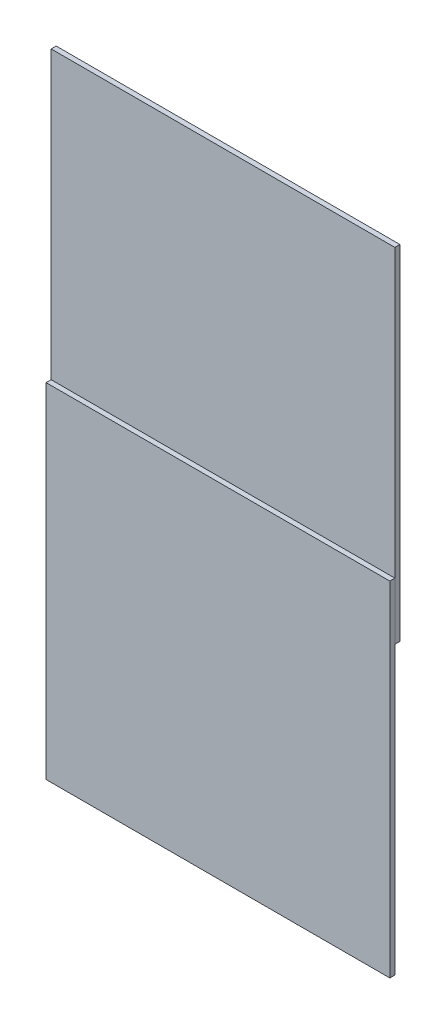
ISO-10303-21;
HEADER;
FILE_DESCRIPTION(('STEP AP214'),'2;1');
FILE_NAME('part.step','',(''),(''),'','','');
FILE_SCHEMA(('AUTOMOTIVE_DESIGN { 1 0 10303 214 1 1 1 1 }'));
ENDSEC;
DATA;
#1=APPLICATION_CONTEXT('core data for automotive mechanical design processes');
#2=APPLICATION_PROTOCOL_DEFINITION('international standard','automotive_design',2000,#1);
#3=PRODUCT_CONTEXT('',#1,'mechanical');
#4=PRODUCT('Part','Part','',(#3));
#5=PRODUCT_RELATED_PRODUCT_CATEGORY('part','',(#4));
#6=PRODUCT_DEFINITION_FORMATION('','',#4);
#7=PRODUCT_DEFINITION_CONTEXT('part definition',#1,'design');
#8=PRODUCT_DEFINITION('design','',#6,#7);
#9=PRODUCT_DEFINITION_SHAPE('','',#8);
#10=(LENGTH_UNIT() NAMED_UNIT(*) SI_UNIT(.MILLI.,.METRE.));
#11=(NAMED_UNIT(*) PLANE_ANGLE_UNIT() SI_UNIT($,.RADIAN.));
#12=(NAMED_UNIT(*) SI_UNIT($,.STERADIAN.) SOLID_ANGLE_UNIT());
#13=UNCERTAINTY_MEASURE_WITH_UNIT(LENGTH_MEASURE(1.E-05),#10,'distance_accuracy_value','');
#14=(GEOMETRIC_REPRESENTATION_CONTEXT(3) GLOBAL_UNCERTAINTY_ASSIGNED_CONTEXT((#13)) GLOBAL_UNIT_ASSIGNED_CONTEXT((#10,
#11,#12)) REPRESENTATION_CONTEXT('',''));
#15=CARTESIAN_POINT('',(0.,0.,0.));
#16=DIRECTION('',(0.,0.,1.));
#17=DIRECTION('',(1.,0.,0.));
#18=AXIS2_PLACEMENT_3D('',#15,#16,#17);
#19=CARTESIAN_POINT('',(92.405874956205,0.,-14.7));
#20=DIRECTION('',(0.,-1.,0.));
#21=DIRECTION('',(1.,0.,0.));
#22=AXIS2_PLACEMENT_3D('',#19,#20,#21);
#23=CYLINDRICAL_SURFACE('',#22,12.5);
#24=CARTESIAN_POINT('',(92.405874956205,0.,-14.7));
#25=DIRECTION('',(0.,-1.,0.));
#26=DIRECTION('',(1.,0.,0.));
#27=AXIS2_PLACEMENT_3D('',#24,#25,#26);
#28=CIRCLE('',#27,12.5);
#29=CARTESIAN_POINT('',(104.905874956205,0.,-14.7));
#30=VERTEX_POINT('',#29);
#31=EDGE_CURVE('E11',#30,#30,#28,.T.);
#32=ORIENTED_EDGE('',*,*,#31,.T.);
#33=EDGE_LOOP('',(#32));
#34=FACE_BOUND('',#33,.T.);
#35=CARTESIAN_POINT('',(92.405874956205,-25.,-14.7));
#36=DIRECTION('',(0.,-1.,0.));
#37=DIRECTION('',(1.,0.,0.));
#38=AXIS2_PLACEMENT_3D('',#35,#36,#37);
#39=CIRCLE('',#38,12.5);
#40=CARTESIAN_POINT('',(104.905874956205,-25.,-14.7));
#41=VERTEX_POINT('',#40);
#42=EDGE_CURVE('E47',#41,#41,#39,.T.);
#43=ORIENTED_EDGE('',*,*,#42,.F.);
#44=EDGE_LOOP('',(#43));
#45=FACE_BOUND('',#44,.T.);
#46=ADVANCED_FACE('F44',(#34,#45),#23,.T.);
#47=CARTESIAN_POINT('',(92.405874956205,0.,-14.7));
#48=DIRECTION('',(0.,-1.,0.));
#49=DIRECTION('',(1.,0.,0.));
#50=AXIS2_PLACEMENT_3D('',#47,#48,#49);
#51=PLANE('',#50);
#52=ORIENTED_EDGE('',*,*,#31,.F.);
#53=EDGE_LOOP('',(#52));
#54=FACE_BOUND('',#53,.T.);
#55=ADVANCED_FACE('F59',(#54),#51,.F.);
#56=CARTESIAN_POINT('',(92.405874956205,-25.,-14.7));
#57=DIRECTION('',(0.,-1.,0.));
#58=DIRECTION('',(1.,0.,0.));
#59=AXIS2_PLACEMENT_3D('',#56,#57,#58);
#60=PLANE('',#59);
#61=ORIENTED_EDGE('',*,*,#42,.T.);
#62=EDGE_LOOP('',(#61));
#63=FACE_BOUND('',#62,.T.);
#64=ADVANCED_FACE('F56',(#63),#60,.T.);
#65=CLOSED_SHELL('',(#46,#55,#64));
#66=MANIFOLD_SOLID_BREP('B2',#65);
#67=CARTESIAN_POINT('',(0.,-25.,-2.2));
#68=DIRECTION('',(1.,0.,0.));
#69=DIRECTION('',(0.,0.,-1.));
#70=AXIS2_PLACEMENT_3D('',#67,#68,#69);
#71=PLANE('',#70);
#72=DIRECTION('',(0.,1.,0.));
#73=VECTOR('',#72,1.);
#74=CARTESIAN_POINT('',(0.,-25.,0.));
#75=LINE('',#74,#73);
#76=CARTESIAN_POINT('',(0.,-25.,0.));
#77=VERTEX_POINT('',#76);
#78=CARTESIAN_POINT('',(0.,125.,0.));
#79=VERTEX_POINT('',#78);
#80=EDGE_CURVE('E157',#77,#79,#75,.T.);
#81=ORIENTED_EDGE('',*,*,#80,.T.);
#82=DIRECTION('',(0.,0.,1.));
#83=VECTOR('',#82,1.);
#84=CARTESIAN_POINT('',(0.,125.,-2.2));
#85=LINE('',#84,#83);
#86=CARTESIAN_POINT('',(0.,125.,-2.2));
#87=VERTEX_POINT('',#86);
#88=EDGE_CURVE('E42',#87,#79,#85,.T.);
#89=ORIENTED_EDGE('',*,*,#88,.F.);
#90=DIRECTION('',(0.,1.,0.));
#91=VECTOR('',#90,1.);
#92=CARTESIAN_POINT('',(0.,-25.,-2.2));
#93=LINE('',#92,#91);
#94=CARTESIAN_POINT('',(0.,-25.,-2.2));
#95=VERTEX_POINT('',#94);
#96=EDGE_CURVE('E145',#95,#87,#93,.T.);
#97=ORIENTED_EDGE('',*,*,#96,.F.);
#98=DIRECTION('',(0.,0.,1.));
#99=VECTOR('',#98,1.);
#100=CARTESIAN_POINT('',(0.,-25.,-2.2));
#101=LINE('',#100,#99);
#102=EDGE_CURVE('E153',#95,#77,#101,.T.);
#103=ORIENTED_EDGE('',*,*,#102,.T.);
#104=EDGE_LOOP('',(#81,#89,#97,#103));
#105=FACE_BOUND('',#104,.T.);
#106=ADVANCED_FACE('F94',(#105),#71,.F.);
#107=CARTESIAN_POINT('',(0.,125.,-2.2));
#108=DIRECTION('',(0.,-1.,0.));
#109=DIRECTION('',(1.,0.,0.));
#110=AXIS2_PLACEMENT_3D('',#107,#108,#109);
#111=PLANE('',#110);
#112=DIRECTION('',(1.,0.,0.));
#113=VECTOR('',#112,1.);
#114=CARTESIAN_POINT('',(0.,125.,0.));
#115=LINE('',#114,#113);
#116=CARTESIAN_POINT('',(150.,125.,0.));
#117=VERTEX_POINT('',#116);
#118=EDGE_CURVE('E149',#79,#117,#115,.T.);
#119=ORIENTED_EDGE('',*,*,#118,.T.);
#120=DIRECTION('',(0.,0.,1.));
#121=VECTOR('',#120,1.);
#122=CARTESIAN_POINT('',(150.,125.,-2.2));
#123=LINE('',#122,#121);
#124=CARTESIAN_POINT('',(150.,125.,-2.2));
#125=VERTEX_POINT('',#124);
#126=EDGE_CURVE('E102',#125,#117,#123,.T.);
#127=ORIENTED_EDGE('',*,*,#126,.F.);
#128=DIRECTION('',(1.,0.,0.));
#129=VECTOR('',#128,1.);
#130=CARTESIAN_POINT('',(0.,125.,-2.2));
#131=LINE('',#130,#129);
#132=EDGE_CURVE('E140',#87,#125,#131,.T.);
#133=ORIENTED_EDGE('',*,*,#132,.F.);
#134=ORIENTED_EDGE('',*,*,#88,.T.);
#135=EDGE_LOOP('',(#119,#127,#133,#134));
#136=FACE_BOUND('',#135,.T.);
#137=ADVANCED_FACE('F148',(#136),#111,.F.);
#138=CARTESIAN_POINT('',(150.,-25.,-2.2));
#139=DIRECTION('',(-1.,0.,0.));
#140=DIRECTION('',(0.,0.,1.));
#141=AXIS2_PLACEMENT_3D('',#138,#139,#140);
#142=PLANE('',#141);
#143=DIRECTION('',(0.,-1.,0.));
#144=VECTOR('',#143,1.);
#145=CARTESIAN_POINT('',(150.,-25.,0.));
#146=LINE('',#145,#144);
#147=CARTESIAN_POINT('',(150.,-25.,0.));
#148=VERTEX_POINT('',#147);
#149=EDGE_CURVE('E127',#117,#148,#146,.T.);
#150=ORIENTED_EDGE('',*,*,#149,.T.);
#151=DIRECTION('',(0.,0.,1.));
#152=VECTOR('',#151,1.);
#153=CARTESIAN_POINT('',(150.,-25.,-2.2));
#154=LINE('',#153,#152);
#155=CARTESIAN_POINT('',(150.,-25.,-2.2));
#156=VERTEX_POINT('',#155);
#157=EDGE_CURVE('E150',#156,#148,#154,.T.);
#158=ORIENTED_EDGE('',*,*,#157,.F.);
#159=DIRECTION('',(0.,-1.,0.));
#160=VECTOR('',#159,1.);
#161=CARTESIAN_POINT('',(150.,-25.,-2.2));
#162=LINE('',#161,#160);
#163=EDGE_CURVE('E143',#125,#156,#162,.T.);
#164=ORIENTED_EDGE('',*,*,#163,.F.);
#165=ORIENTED_EDGE('',*,*,#126,.T.);
#166=EDGE_LOOP('',(#150,#158,#164,#165));
#167=FACE_BOUND('',#166,.T.);
#168=ADVANCED_FACE('F151',(#167),#142,.F.);
#169=CARTESIAN_POINT('',(0.,-25.,-2.2));
#170=DIRECTION('',(0.,1.,0.));
#171=DIRECTION('',(-1.,0.,0.));
#172=AXIS2_PLACEMENT_3D('',#169,#170,#171);
#173=PLANE('',#172);
#174=DIRECTION('',(-1.,0.,0.));
#175=VECTOR('',#174,1.);
#176=CARTESIAN_POINT('',(0.,-25.,0.));
#177=LINE('',#176,#175);
#178=EDGE_CURVE('E133',#148,#77,#177,.T.);
#179=ORIENTED_EDGE('',*,*,#178,.T.);
#180=ORIENTED_EDGE('',*,*,#102,.F.);
#181=DIRECTION('',(-1.,0.,0.));
#182=VECTOR('',#181,1.);
#183=CARTESIAN_POINT('',(0.,-25.,-2.2));
#184=LINE('',#183,#182);
#185=EDGE_CURVE('E110',#156,#95,#184,.T.);
#186=ORIENTED_EDGE('',*,*,#185,.F.);
#187=ORIENTED_EDGE('',*,*,#157,.T.);
#188=EDGE_LOOP('',(#179,#180,#186,#187));
#189=FACE_BOUND('',#188,.T.);
#190=ADVANCED_FACE('F164',(#189),#173,.F.);
#191=CARTESIAN_POINT('',(0.,0.,-2.2));
#192=DIRECTION('',(0.,0.,-1.));
#193=DIRECTION('',(-1.,0.,0.));
#194=AXIS2_PLACEMENT_3D('',#191,#192,#193);
#195=PLANE('',#194);
#196=ORIENTED_EDGE('',*,*,#96,.T.);
#197=ORIENTED_EDGE('',*,*,#132,.T.);
#198=ORIENTED_EDGE('',*,*,#163,.T.);
#199=ORIENTED_EDGE('',*,*,#185,.T.);
#200=EDGE_LOOP('',(#196,#197,#198,#199));
#201=FACE_BOUND('',#200,.T.);
#202=ADVANCED_FACE('F141',(#201),#195,.T.);
#203=CARTESIAN_POINT('',(0.,0.,0.));
#204=DIRECTION('',(0.,0.,-1.));
#205=DIRECTION('',(-1.,0.,0.));
#206=AXIS2_PLACEMENT_3D('',#203,#204,#205);
#207=PLANE('',#206);
#208=ORIENTED_EDGE('',*,*,#80,.F.);
#209=ORIENTED_EDGE('',*,*,#178,.F.);
#210=ORIENTED_EDGE('',*,*,#149,.F.);
#211=ORIENTED_EDGE('',*,*,#118,.F.);
#212=EDGE_LOOP('',(#208,#209,#210,#211));
#213=FACE_BOUND('',#212,.T.);
#214=ADVANCED_FACE('F167',(#213),#207,.F.);
#215=CLOSED_SHELL('',(#106,#137,#168,#190,#202,#214));
#216=MANIFOLD_SOLID_BREP('B6',#215);
#217=CARTESIAN_POINT('',(0.,0.,2.2));
#218=DIRECTION('',(1.,0.,0.));
#219=DIRECTION('',(0.,1.,0.));
#220=AXIS2_PLACEMENT_3D('',#217,#218,#219);
#221=PLANE('',#220);
#222=DIRECTION('',(0.,-1.,0.));
#223=VECTOR('',#222,1.);
#224=CARTESIAN_POINT('',(0.,0.,0.));
#225=LINE('',#224,#223);
#226=CARTESIAN_POINT('',(0.,0.,0.));
#227=VERTEX_POINT('',#226);
#228=CARTESIAN_POINT('',(0.,-150.,0.));
#229=VERTEX_POINT('',#228);
#230=EDGE_CURVE('E281',#227,#229,#225,.T.);
#231=ORIENTED_EDGE('',*,*,#230,.T.);
#232=DIRECTION('',(0.,0.,-1.));
#233=VECTOR('',#232,1.);
#234=CARTESIAN_POINT('',(0.,-150.,2.2));
#235=LINE('',#234,#233);
#236=CARTESIAN_POINT('',(0.,-150.,2.2));
#237=VERTEX_POINT('',#236);
#238=EDGE_CURVE('E92',#237,#229,#235,.T.);
#239=ORIENTED_EDGE('',*,*,#238,.F.);
#240=DIRECTION('',(0.,-1.,0.));
#241=VECTOR('',#240,1.);
#242=CARTESIAN_POINT('',(0.,0.,2.2));
#243=LINE('',#242,#241);
#244=CARTESIAN_POINT('',(0.,0.,2.2));
#245=VERTEX_POINT('',#244);
#246=EDGE_CURVE('E269',#245,#237,#243,.T.);
#247=ORIENTED_EDGE('',*,*,#246,.F.);
#248=DIRECTION('',(0.,0.,-1.));
#249=VECTOR('',#248,1.);
#250=CARTESIAN_POINT('',(0.,0.,2.2));
#251=LINE('',#250,#249);
#252=EDGE_CURVE('E277',#245,#227,#251,.T.);
#253=ORIENTED_EDGE('',*,*,#252,.T.);
#254=EDGE_LOOP('',(#231,#239,#247,#253));
#255=FACE_BOUND('',#254,.T.);
#256=ADVANCED_FACE('F218',(#255),#221,.F.);
#257=CARTESIAN_POINT('',(0.,-150.,2.2));
#258=DIRECTION('',(0.,1.,0.));
#259=DIRECTION('',(0.,0.,1.));
#260=AXIS2_PLACEMENT_3D('',#257,#258,#259);
#261=PLANE('',#260);
#262=DIRECTION('',(1.,0.,0.));
#263=VECTOR('',#262,1.);
#264=CARTESIAN_POINT('',(0.,-150.,0.));
#265=LINE('',#264,#263);
#266=CARTESIAN_POINT('',(150.,-150.,0.));
#267=VERTEX_POINT('',#266);
#268=EDGE_CURVE('E273',#229,#267,#265,.T.);
#269=ORIENTED_EDGE('',*,*,#268,.T.);
#270=DIRECTION('',(0.,0.,-1.));
#271=VECTOR('',#270,1.);
#272=CARTESIAN_POINT('',(150.,-150.,2.2));
#273=LINE('',#272,#271);
#274=CARTESIAN_POINT('',(150.,-150.,2.2));
#275=VERTEX_POINT('',#274);
#276=EDGE_CURVE('E226',#275,#267,#273,.T.);
#277=ORIENTED_EDGE('',*,*,#276,.F.);
#278=DIRECTION('',(1.,0.,0.));
#279=VECTOR('',#278,1.);
#280=CARTESIAN_POINT('',(0.,-150.,2.2));
#281=LINE('',#280,#279);
#282=EDGE_CURVE('E264',#237,#275,#281,.T.);
#283=ORIENTED_EDGE('',*,*,#282,.F.);
#284=ORIENTED_EDGE('',*,*,#238,.T.);
#285=EDGE_LOOP('',(#269,#277,#283,#284));
#286=FACE_BOUND('',#285,.T.);
#287=ADVANCED_FACE('F272',(#286),#261,.F.);
#288=CARTESIAN_POINT('',(150.,0.,2.2));
#289=DIRECTION('',(-1.,0.,0.));
#290=DIRECTION('',(0.,-1.,0.));
#291=AXIS2_PLACEMENT_3D('',#288,#289,#290);
#292=PLANE('',#291);
#293=DIRECTION('',(0.,1.,0.));
#294=VECTOR('',#293,1.);
#295=CARTESIAN_POINT('',(150.,0.,0.));
#296=LINE('',#295,#294);
#297=CARTESIAN_POINT('',(150.,0.,0.));
#298=VERTEX_POINT('',#297);
#299=EDGE_CURVE('E251',#267,#298,#296,.T.);
#300=ORIENTED_EDGE('',*,*,#299,.T.);
#301=DIRECTION('',(0.,0.,-1.));
#302=VECTOR('',#301,1.);
#303=CARTESIAN_POINT('',(150.,0.,2.2));
#304=LINE('',#303,#302);
#305=CARTESIAN_POINT('',(150.,0.,2.2));
#306=VERTEX_POINT('',#305);
#307=EDGE_CURVE('E274',#306,#298,#304,.T.);
#308=ORIENTED_EDGE('',*,*,#307,.F.);
#309=DIRECTION('',(0.,1.,0.));
#310=VECTOR('',#309,1.);
#311=CARTESIAN_POINT('',(150.,0.,2.2));
#312=LINE('',#311,#310);
#313=EDGE_CURVE('E267',#275,#306,#312,.T.);
#314=ORIENTED_EDGE('',*,*,#313,.F.);
#315=ORIENTED_EDGE('',*,*,#276,.T.);
#316=EDGE_LOOP('',(#300,#308,#314,#315));
#317=FACE_BOUND('',#316,.T.);
#318=ADVANCED_FACE('F275',(#317),#292,.F.);
#319=CARTESIAN_POINT('',(0.,0.,2.2));
#320=DIRECTION('',(0.,-1.,0.));
#321=DIRECTION('',(0.,0.,-1.));
#322=AXIS2_PLACEMENT_3D('',#319,#320,#321);
#323=PLANE('',#322);
#324=DIRECTION('',(-1.,0.,0.));
#325=VECTOR('',#324,1.);
#326=CARTESIAN_POINT('',(0.,0.,0.));
#327=LINE('',#326,#325);
#328=EDGE_CURVE('E257',#298,#227,#327,.T.);
#329=ORIENTED_EDGE('',*,*,#328,.T.);
#330=ORIENTED_EDGE('',*,*,#252,.F.);
#331=DIRECTION('',(-1.,0.,0.));
#332=VECTOR('',#331,1.);
#333=CARTESIAN_POINT('',(0.,0.,2.2));
#334=LINE('',#333,#332);
#335=EDGE_CURVE('E234',#306,#245,#334,.T.);
#336=ORIENTED_EDGE('',*,*,#335,.F.);
#337=ORIENTED_EDGE('',*,*,#307,.T.);
#338=EDGE_LOOP('',(#329,#330,#336,#337));
#339=FACE_BOUND('',#338,.T.);
#340=ADVANCED_FACE('F288',(#339),#323,.F.);
#341=CARTESIAN_POINT('',(0.,0.,2.2));
#342=DIRECTION('',(0.,0.,1.));
#343=DIRECTION('',(1.,0.,0.));
#344=AXIS2_PLACEMENT_3D('',#341,#342,#343);
#345=PLANE('',#344);
#346=ORIENTED_EDGE('',*,*,#246,.T.);
#347=ORIENTED_EDGE('',*,*,#282,.T.);
#348=ORIENTED_EDGE('',*,*,#313,.T.);
#349=ORIENTED_EDGE('',*,*,#335,.T.);
#350=EDGE_LOOP('',(#346,#347,#348,#349));
#351=FACE_BOUND('',#350,.T.);
#352=ADVANCED_FACE('F265',(#351),#345,.T.);
#353=CARTESIAN_POINT('',(0.,0.,0.));
#354=DIRECTION('',(0.,0.,1.));
#355=DIRECTION('',(1.,0.,0.));
#356=AXIS2_PLACEMENT_3D('',#353,#354,#355);
#357=PLANE('',#356);
#358=ORIENTED_EDGE('',*,*,#230,.F.);
#359=ORIENTED_EDGE('',*,*,#328,.F.);
#360=ORIENTED_EDGE('',*,*,#299,.F.);
#361=ORIENTED_EDGE('',*,*,#268,.F.);
#362=EDGE_LOOP('',(#358,#359,#360,#361));
#363=FACE_BOUND('',#362,.T.);
#364=ADVANCED_FACE('F291',(#363),#357,.F.);
#365=CLOSED_SHELL('',(#256,#287,#318,#340,#352,#364));
#366=MANIFOLD_SOLID_BREP('B36',#365);
#367=ADVANCED_BREP_SHAPE_REPRESENTATION('',(#18,#66,#216,#366),#14);
#368=SHAPE_DEFINITION_REPRESENTATION(#9,#367);
ENDSEC;
END-ISO-10303-21;
